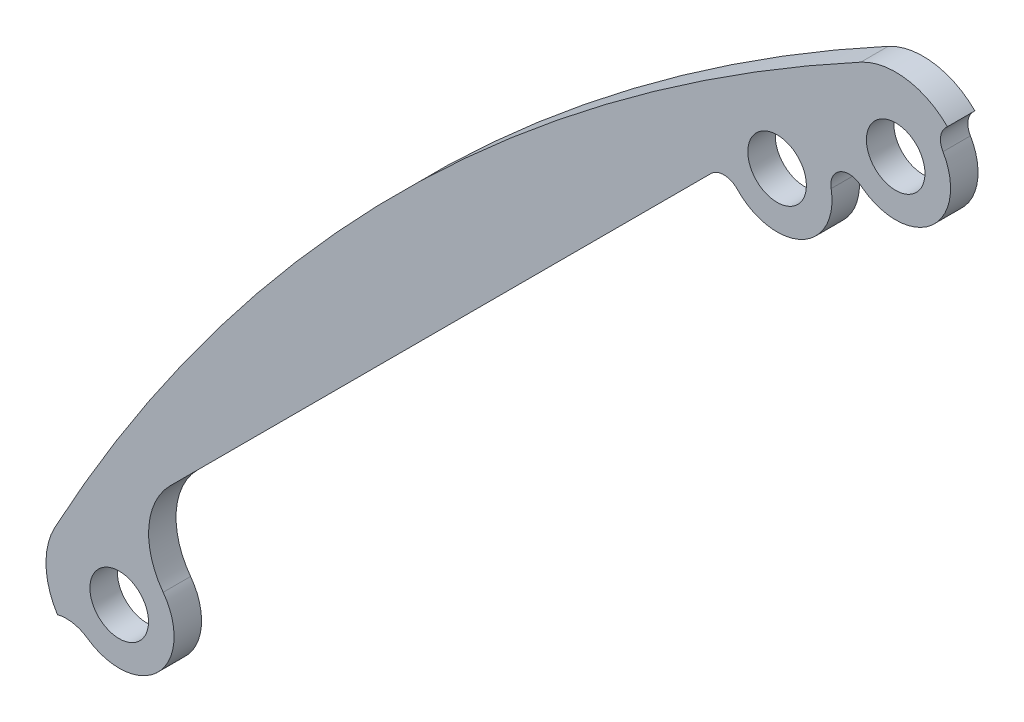
ISO-10303-21;
HEADER;
FILE_DESCRIPTION(('STEP AP214'),'2;1');
FILE_NAME('part.step','',(''),(''),'','','');
FILE_SCHEMA(('AUTOMOTIVE_DESIGN { 1 0 10303 214 1 1 1 1 }'));
ENDSEC;
DATA;
#1=APPLICATION_CONTEXT('core data for automotive mechanical design processes');
#2=APPLICATION_PROTOCOL_DEFINITION('international standard','automotive_design',2000,#1);
#3=PRODUCT_CONTEXT('',#1,'mechanical');
#4=PRODUCT('Part','Part','',(#3));
#5=PRODUCT_RELATED_PRODUCT_CATEGORY('part','',(#4));
#6=PRODUCT_DEFINITION_FORMATION('','',#4);
#7=PRODUCT_DEFINITION_CONTEXT('part definition',#1,'design');
#8=PRODUCT_DEFINITION('design','',#6,#7);
#9=PRODUCT_DEFINITION_SHAPE('','',#8);
#10=(LENGTH_UNIT() NAMED_UNIT(*) SI_UNIT(.MILLI.,.METRE.));
#11=(NAMED_UNIT(*) PLANE_ANGLE_UNIT() SI_UNIT($,.RADIAN.));
#12=(NAMED_UNIT(*) SI_UNIT($,.STERADIAN.) SOLID_ANGLE_UNIT());
#13=UNCERTAINTY_MEASURE_WITH_UNIT(LENGTH_MEASURE(1.E-05),#10,'distance_accuracy_value','');
#14=(GEOMETRIC_REPRESENTATION_CONTEXT(3) GLOBAL_UNCERTAINTY_ASSIGNED_CONTEXT((#13)) GLOBAL_UNIT_ASSIGNED_CONTEXT((#10,
#11,#12)) REPRESENTATION_CONTEXT('',''));
#15=CARTESIAN_POINT('',(0.,0.,0.));
#16=DIRECTION('',(0.,0.,1.));
#17=DIRECTION('',(1.,0.,0.));
#18=AXIS2_PLACEMENT_3D('',#15,#16,#17);
#19=CARTESIAN_POINT('',(-49.9380439181931,92.3644507894832,1.5));
#20=DIRECTION('',(0.,0.,-1.));
#21=DIRECTION('',(-1.,0.,0.));
#22=AXIS2_PLACEMENT_3D('',#19,#20,#21);
#23=CYLINDRICAL_SURFACE('',#22,4.);
#24=DIRECTION('',(0.,0.,-1.));
#25=VECTOR('',#24,1.);
#26=CARTESIAN_POINT('',(-51.8404455912932,95.8830965339181,6.5));
#27=LINE('',#26,#25);
#28=CARTESIAN_POINT('',(-51.8404455912549,95.8830965338473,3.));
#29=VERTEX_POINT('',#28);
#30=CARTESIAN_POINT('',(-51.840445591251,95.88309653384,1.5));
#31=VERTEX_POINT('',#30);
#32=EDGE_CURVE('E262',#29,#31,#27,.T.);
#33=ORIENTED_EDGE('',*,*,#32,.F.);
#34=CARTESIAN_POINT('',(-49.9380439181931,92.3644507894832,3.));
#35=DIRECTION('',(0.,0.,1.));
#36=DIRECTION('',(1.,0.,0.));
#37=AXIS2_PLACEMENT_3D('',#34,#35,#36);
#38=CIRCLE('',#37,4.);
#39=CARTESIAN_POINT('',(-47.1096167933636,95.1928779142894,3.));
#40=VERTEX_POINT('',#39);
#41=EDGE_CURVE('E317',#29,#40,#38,.F.);
#42=ORIENTED_EDGE('',*,*,#41,.T.);
#43=DIRECTION('',(0.,0.,1.));
#44=VECTOR('',#43,1.);
#45=CARTESIAN_POINT('',(-47.1096167933636,95.1928779142894,1.5));
#46=LINE('',#45,#44);
#47=CARTESIAN_POINT('',(-47.1096167934353,95.1928779142177,1.5));
#48=VERTEX_POINT('',#47);
#49=EDGE_CURVE('E267',#48,#40,#46,.T.);
#50=ORIENTED_EDGE('',*,*,#49,.F.);
#51=CARTESIAN_POINT('',(-49.9380439181931,92.3644507894832,1.5));
#52=DIRECTION('',(0.,0.,-1.));
#53=DIRECTION('',(-1.,0.,0.));
#54=AXIS2_PLACEMENT_3D('',#51,#52,#53);
#55=CIRCLE('',#54,4.);
#56=EDGE_CURVE('E284',#48,#31,#55,.F.);
#57=ORIENTED_EDGE('',*,*,#56,.T.);
#58=EDGE_LOOP('',(#33,#42,#50,#57));
#59=FACE_BOUND('',#58,.T.);
#60=ADVANCED_FACE('F101',(#59),#23,.T.);
#61=CARTESIAN_POINT('',(4.84334794492725E-12,9.20178907339733E-11,1.5));
#62=DIRECTION('',(0.,0.,-1.));
#63=DIRECTION('',(-1.,0.,0.));
#64=AXIS2_PLACEMENT_3D('',#61,#62,#63);
#65=CYLINDRICAL_SURFACE('',#64,109.);
#66=DIRECTION('',(0.,0.,1.));
#67=VECTOR('',#66,1.);
#68=CARTESIAN_POINT('',(-95.8830965339179,51.8404455912935,-3.5));
#69=LINE('',#68,#67);
#70=CARTESIAN_POINT('',(-95.8830965339179,51.8404455912935,1.5));
#71=VERTEX_POINT('',#70);
#72=CARTESIAN_POINT('',(-95.8830965338054,51.8404455912327,3.));
#73=VERTEX_POINT('',#72);
#74=EDGE_CURVE('E290',#71,#73,#69,.T.);
#75=ORIENTED_EDGE('',*,*,#74,.T.);
#76=CARTESIAN_POINT('',(4.84334794492725E-12,9.20178907339733E-11,3.));
#77=DIRECTION('',(0.,0.,1.));
#78=DIRECTION('',(1.,0.,0.));
#79=AXIS2_PLACEMENT_3D('',#76,#77,#78);
#80=CIRCLE('',#79,109.);
#81=EDGE_CURVE('E310',#73,#29,#80,.F.);
#82=ORIENTED_EDGE('',*,*,#81,.T.);
#83=ORIENTED_EDGE('',*,*,#32,.T.);
#84=CARTESIAN_POINT('',(0.,0.,1.5));
#85=DIRECTION('',(0.,0.,1.));
#86=DIRECTION('',(1.,0.,0.));
#87=AXIS2_PLACEMENT_3D('',#84,#85,#86);
#88=CIRCLE('',#87,109.000000000167);
#89=EDGE_CURVE('E264',#31,#71,#88,.T.);
#90=ORIENTED_EDGE('',*,*,#89,.T.);
#91=EDGE_LOOP('',(#75,#82,#83,#90));
#92=FACE_BOUND('',#91,.T.);
#93=ADVANCED_FACE('F357',(#92),#65,.T.);
#94=CARTESIAN_POINT('',(-49.9380439181764,92.3644507894767,0.));
#95=DIRECTION('',(0.,0.,1.));
#96=DIRECTION('',(1.,0.,0.));
#97=AXIS2_PLACEMENT_3D('',#94,#95,#96);
#98=CYLINDRICAL_SURFACE('',#97,1.6);
#99=CARTESIAN_POINT('',(-49.9380439181764,92.3644507894767,1.5));
#100=DIRECTION('',(0.,0.,-1.));
#101=DIRECTION('',(-1.,0.,0.));
#102=AXIS2_PLACEMENT_3D('',#99,#100,#101);
#103=CIRCLE('',#102,1.6);
#104=CARTESIAN_POINT('',(-51.5380439181764,92.3644507894767,1.5));
#105=VERTEX_POINT('',#104);
#106=EDGE_CURVE('E272',#105,#105,#103,.F.);
#107=ORIENTED_EDGE('',*,*,#106,.F.);
#108=EDGE_LOOP('',(#107));
#109=FACE_BOUND('',#108,.T.);
#110=CARTESIAN_POINT('',(-49.9380439181764,92.3644507894767,3.));
#111=DIRECTION('',(0.,0.,1.));
#112=DIRECTION('',(1.,0.,0.));
#113=AXIS2_PLACEMENT_3D('',#110,#111,#112);
#114=CIRCLE('',#113,1.6);
#115=CARTESIAN_POINT('',(-48.3380439181764,92.3644507894767,3.));
#116=VERTEX_POINT('',#115);
#117=EDGE_CURVE('E233',#116,#116,#114,.F.);
#118=ORIENTED_EDGE('',*,*,#117,.F.);
#119=EDGE_LOOP('',(#118));
#120=FACE_BOUND('',#119,.T.);
#121=ADVANCED_FACE('F390',(#109,#120),#98,.F.);
#122=CARTESIAN_POINT('',(-92.3644507894765,49.9380439181767,0.));
#123=DIRECTION('',(0.,0.,1.));
#124=DIRECTION('',(1.,0.,0.));
#125=AXIS2_PLACEMENT_3D('',#122,#123,#124);
#126=CYLINDRICAL_SURFACE('',#125,1.59999999999998);
#127=CARTESIAN_POINT('',(-92.3644507894765,49.9380439181767,1.5));
#128=DIRECTION('',(0.,0.,-1.));
#129=DIRECTION('',(-1.,0.,0.));
#130=AXIS2_PLACEMENT_3D('',#127,#128,#129);
#131=CIRCLE('',#130,1.59999999999998);
#132=CARTESIAN_POINT('',(-93.9644507894765,49.9380439181767,1.5));
#133=VERTEX_POINT('',#132);
#134=EDGE_CURVE('E281',#133,#133,#131,.F.);
#135=ORIENTED_EDGE('',*,*,#134,.F.);
#136=EDGE_LOOP('',(#135));
#137=FACE_BOUND('',#136,.T.);
#138=CARTESIAN_POINT('',(-92.3644507894765,49.9380439181767,3.));
#139=DIRECTION('',(0.,0.,1.));
#140=DIRECTION('',(1.,0.,0.));
#141=AXIS2_PLACEMENT_3D('',#138,#139,#140);
#142=CIRCLE('',#141,1.59999999999998);
#143=CARTESIAN_POINT('',(-90.7644507894766,49.9380439181767,3.));
#144=VERTEX_POINT('',#143);
#145=EDGE_CURVE('E300',#144,#144,#142,.F.);
#146=ORIENTED_EDGE('',*,*,#145,.F.);
#147=EDGE_LOOP('',(#146));
#148=FACE_BOUND('',#147,.T.);
#149=ADVANCED_FACE('F422',(#137,#148),#126,.F.);
#150=CARTESIAN_POINT('',(-92.3644507894765,49.9380439181767,1.5));
#151=DIRECTION('',(0.,0.,1.));
#152=DIRECTION('',(1.,0.,0.));
#153=AXIS2_PLACEMENT_3D('',#150,#151,#152);
#154=CYLINDRICAL_SURFACE('',#153,3.00000000000003);
#155=CARTESIAN_POINT('',(-92.3644507894765,49.9380439181767,3.));
#156=DIRECTION('',(0.,0.,1.));
#157=DIRECTION('',(1.,0.,0.));
#158=AXIS2_PLACEMENT_3D('',#155,#156,#157);
#159=CIRCLE('',#158,3.00000000000003);
#160=CARTESIAN_POINT('',(-94.0905838642911,47.4843804106778,3.));
#161=VERTEX_POINT('',#160);
#162=CARTESIAN_POINT('',(-89.9618423894396,51.7345607914823,3.));
#163=VERTEX_POINT('',#162);
#164=EDGE_CURVE('E313',#161,#163,#159,.T.);
#165=ORIENTED_EDGE('',*,*,#164,.F.);
#166=DIRECTION('',(0.,0.,1.));
#167=VECTOR('',#166,1.);
#168=CARTESIAN_POINT('',(-94.0905838642911,47.4843804106778,1.5));
#169=LINE('',#168,#167);
#170=CARTESIAN_POINT('',(-94.0905838642911,47.4843804106778,1.5));
#171=VERTEX_POINT('',#170);
#172=EDGE_CURVE('E251',#161,#171,#169,.F.);
#173=ORIENTED_EDGE('',*,*,#172,.T.);
#174=CARTESIAN_POINT('',(-92.3644507894765,49.9380439181767,1.5));
#175=DIRECTION('',(0.,0.,-1.));
#176=DIRECTION('',(-1.,0.,0.));
#177=AXIS2_PLACEMENT_3D('',#174,#175,#176);
#178=CIRCLE('',#177,3.00000000000003);
#179=CARTESIAN_POINT('',(-89.9618423894396,51.7345607914823,1.5));
#180=VERTEX_POINT('',#179);
#181=EDGE_CURVE('E268',#180,#171,#178,.T.);
#182=ORIENTED_EDGE('',*,*,#181,.F.);
#183=DIRECTION('',(0.,0.,1.));
#184=VECTOR('',#183,1.);
#185=CARTESIAN_POINT('',(-89.9618423894396,51.7345607914823,1.5));
#186=LINE('',#185,#184);
#187=EDGE_CURVE('E245',#180,#163,#186,.T.);
#188=ORIENTED_EDGE('',*,*,#187,.T.);
#189=EDGE_LOOP('',(#165,#173,#182,#188));
#190=FACE_BOUND('',#189,.T.);
#191=ADVANCED_FACE('F347',(#190),#154,.T.);
#192=CARTESIAN_POINT('',(-49.9380439181764,92.3644507894767,1.5));
#193=DIRECTION('',(0.,0.,1.));
#194=DIRECTION('',(1.,0.,0.));
#195=AXIS2_PLACEMENT_3D('',#192,#193,#194);
#196=CYLINDRICAL_SURFACE('',#195,3.);
#197=CARTESIAN_POINT('',(-49.9380439181764,92.3644507894767,3.));
#198=DIRECTION('',(0.,0.,1.));
#199=DIRECTION('',(1.,0.,0.));
#200=AXIS2_PLACEMENT_3D('',#197,#198,#199);
#201=CIRCLE('',#200,3.);
#202=CARTESIAN_POINT('',(-51.734560791482,89.9618423894398,3.));
#203=VERTEX_POINT('',#202);
#204=CARTESIAN_POINT('',(-47.3537542416421,93.8880802942312,3.));
#205=VERTEX_POINT('',#204);
#206=EDGE_CURVE('E210',#203,#205,#201,.T.);
#207=ORIENTED_EDGE('',*,*,#206,.F.);
#208=DIRECTION('',(0.,0.,1.));
#209=VECTOR('',#208,1.);
#210=CARTESIAN_POINT('',(-51.734560791482,89.9618423894398,1.5));
#211=LINE('',#210,#209);
#212=CARTESIAN_POINT('',(-51.734560791482,89.9618423894398,1.5));
#213=VERTEX_POINT('',#212);
#214=EDGE_CURVE('E209',#203,#213,#211,.F.);
#215=ORIENTED_EDGE('',*,*,#214,.T.);
#216=CARTESIAN_POINT('',(-49.9380439181764,92.3644507894767,1.5));
#217=DIRECTION('',(0.,0.,-1.));
#218=DIRECTION('',(-1.,0.,0.));
#219=AXIS2_PLACEMENT_3D('',#216,#217,#218);
#220=CIRCLE('',#219,3.);
#221=CARTESIAN_POINT('',(-47.3537542416421,93.8880802942312,1.5));
#222=VERTEX_POINT('',#221);
#223=EDGE_CURVE('E271',#222,#213,#220,.T.);
#224=ORIENTED_EDGE('',*,*,#223,.F.);
#225=DIRECTION('',(0.,0.,1.));
#226=VECTOR('',#225,1.);
#227=CARTESIAN_POINT('',(-47.3537542416421,93.8880802942312,1.5));
#228=LINE('',#227,#226);
#229=EDGE_CURVE('E257',#222,#205,#228,.T.);
#230=ORIENTED_EDGE('',*,*,#229,.T.);
#231=EDGE_LOOP('',(#207,#215,#224,#230));
#232=FACE_BOUND('',#231,.T.);
#233=ADVANCED_FACE('F373',(#232),#196,.T.);
#234=CARTESIAN_POINT('',(-47.8167235746167,94.4857711330363,1.5));
#235=DIRECTION('',(-0.707106781186537,0.707106781186558,0.));
#236=DIRECTION('',(-0.707106781186558,-0.707106781186537,0.));
#237=AXIS2_PLACEMENT_3D('',#234,#235,#236);
#238=PLANE('',#237);
#239=DIRECTION('',(0.707106781186558,0.707106781186537,0.));
#240=VECTOR('',#239,1.);
#241=CARTESIAN_POINT('',(-47.8167235746167,94.4857711330363,3.));
#242=LINE('',#241,#240);
#243=CARTESIAN_POINT('',(-47.1994311306505,95.1030635770025,3.));
#244=VERTEX_POINT('',#243);
#245=EDGE_CURVE('E320',#244,#40,#242,.T.);
#246=ORIENTED_EDGE('',*,*,#245,.F.);
#247=DIRECTION('',(0.,0.,-1.));
#248=VECTOR('',#247,1.);
#249=CARTESIAN_POINT('',(-47.1994311306505,95.1030635770025,1.5));
#250=LINE('',#249,#248);
#251=CARTESIAN_POINT('',(-47.1994311306505,95.1030635770025,1.5));
#252=VERTEX_POINT('',#251);
#253=EDGE_CURVE('E255',#244,#252,#250,.T.);
#254=ORIENTED_EDGE('',*,*,#253,.T.);
#255=DIRECTION('',(-0.707106781186558,-0.707106781186537,0.));
#256=VECTOR('',#255,1.);
#257=CARTESIAN_POINT('',(-47.8167235746167,94.4857711330363,1.5));
#258=LINE('',#257,#256);
#259=EDGE_CURVE('E275',#48,#252,#258,.T.);
#260=ORIENTED_EDGE('',*,*,#259,.F.);
#261=ORIENTED_EDGE('',*,*,#49,.T.);
#262=EDGE_LOOP('',(#246,#254,#260,#261));
#263=FACE_BOUND('',#262,.T.);
#264=ADVANCED_FACE('F365',(#263),#238,.F.);
#265=CARTESIAN_POINT('',(-46.4923243494639,94.395956795816,1.5));
#266=DIRECTION('',(0.,0.,1.));
#267=DIRECTION('',(1.,0.,0.));
#268=AXIS2_PLACEMENT_3D('',#265,#266,#267);
#269=CYLINDRICAL_SURFACE('',#268,1.);
#270=CARTESIAN_POINT('',(-46.4923243494639,94.395956795816,3.));
#271=DIRECTION('',(0.,0.,1.));
#272=DIRECTION('',(1.,0.,0.));
#273=AXIS2_PLACEMENT_3D('',#270,#271,#272);
#274=CIRCLE('',#273,1.);
#275=EDGE_CURVE('E322',#205,#244,#274,.F.);
#276=ORIENTED_EDGE('',*,*,#275,.F.);
#277=ORIENTED_EDGE('',*,*,#229,.F.);
#278=CARTESIAN_POINT('',(-46.4923243494639,94.395956795816,1.5));
#279=DIRECTION('',(0.,0.,1.));
#280=DIRECTION('',(1.,0.,0.));
#281=AXIS2_PLACEMENT_3D('',#278,#279,#280);
#282=CIRCLE('',#281,1.);
#283=EDGE_CURVE('E253',#252,#222,#282,.T.);
#284=ORIENTED_EDGE('',*,*,#283,.F.);
#285=ORIENTED_EDGE('',*,*,#253,.F.);
#286=EDGE_LOOP('',(#276,#277,#284,#285));
#287=FACE_BOUND('',#286,.T.);
#288=ADVANCED_FACE('F369',(#287),#269,.F.);
#289=CARTESIAN_POINT('',(-95.2413392475008,45.848604739012,1.5));
#290=DIRECTION('',(0.,0.,-1.));
#291=DIRECTION('',(-1.,0.,0.));
#292=AXIS2_PLACEMENT_3D('',#289,#290,#291);
#293=CYLINDRICAL_SURFACE('',#292,2.);
#294=CARTESIAN_POINT('',(-95.2413392475008,45.848604739012,3.));
#295=DIRECTION('',(0.,0.,1.));
#296=DIRECTION('',(1.,0.,0.));
#297=AXIS2_PLACEMENT_3D('',#294,#295,#296);
#298=CIRCLE('',#297,2.);
#299=CARTESIAN_POINT('',(-95.7364301374804,47.7863573059145,3.));
#300=VERTEX_POINT('',#299);
#301=EDGE_CURVE('E306',#300,#161,#298,.F.);
#302=ORIENTED_EDGE('',*,*,#301,.F.);
#303=DIRECTION('',(0.,0.,-1.));
#304=VECTOR('',#303,1.);
#305=CARTESIAN_POINT('',(-95.7364301374243,47.7863573057409,6.5));
#306=LINE('',#305,#304);
#307=CARTESIAN_POINT('',(-95.7364301372988,47.7863573059923,1.5));
#308=VERTEX_POINT('',#307);
#309=EDGE_CURVE('E260',#300,#308,#306,.T.);
#310=ORIENTED_EDGE('',*,*,#309,.T.);
#311=CARTESIAN_POINT('',(-95.2413392475008,45.848604739012,1.5));
#312=DIRECTION('',(0.,0.,1.));
#313=DIRECTION('',(1.,0.,0.));
#314=AXIS2_PLACEMENT_3D('',#311,#312,#313);
#315=CIRCLE('',#314,2.);
#316=EDGE_CURVE('E248',#171,#308,#315,.T.);
#317=ORIENTED_EDGE('',*,*,#316,.F.);
#318=ORIENTED_EDGE('',*,*,#172,.F.);
#319=EDGE_LOOP('',(#302,#310,#317,#318));
#320=FACE_BOUND('',#319,.T.);
#321=ADVANCED_FACE('F351',(#320),#293,.F.);
#322=CARTESIAN_POINT('',(-92.3644507894765,49.9380439181767,-3.5));
#323=DIRECTION('',(0.,0.,1.));
#324=DIRECTION('',(1.,0.,0.));
#325=AXIS2_PLACEMENT_3D('',#322,#323,#324);
#326=CYLINDRICAL_SURFACE('',#325,4.00000000009412);
#327=CARTESIAN_POINT('',(-92.3644507894765,49.9380439181767,3.));
#328=DIRECTION('',(0.,0.,1.));
#329=DIRECTION('',(1.,0.,0.));
#330=AXIS2_PLACEMENT_3D('',#327,#328,#329);
#331=CIRCLE('',#330,4.00000000009412);
#332=EDGE_CURVE('E308',#73,#300,#331,.T.);
#333=ORIENTED_EDGE('',*,*,#332,.F.);
#334=ORIENTED_EDGE('',*,*,#74,.F.);
#335=CARTESIAN_POINT('',(-92.3644507894765,49.9380439181767,1.5));
#336=DIRECTION('',(0.,0.,1.));
#337=DIRECTION('',(1.,0.,0.));
#338=AXIS2_PLACEMENT_3D('',#335,#336,#337);
#339=CIRCLE('',#338,4.00000000009412);
#340=EDGE_CURVE('E287',#308,#71,#339,.F.);
#341=ORIENTED_EDGE('',*,*,#340,.F.);
#342=ORIENTED_EDGE('',*,*,#309,.F.);
#343=EDGE_LOOP('',(#333,#334,#341,#342));
#344=FACE_BOUND('',#343,.T.);
#345=ADVANCED_FACE('F375',(#344),#326,.T.);
#346=CARTESIAN_POINT('',(-52.059364261736,94.4857711330364,-3.5));
#347=DIRECTION('',(-0.707106781186546,0.707106781186549,0.));
#348=DIRECTION('',(-0.707106781186549,-0.707106781186546,0.));
#349=AXIS2_PLACEMENT_3D('',#346,#347,#348);
#350=PLANE('',#349);
#351=DIRECTION('',(0.707106781186549,0.707106781186546,0.));
#352=VECTOR('',#351,1.);
#353=CARTESIAN_POINT('',(-52.059364261736,94.4857711330364,3.));
#354=LINE('',#353,#352);
#355=CARTESIAN_POINT('',(-89.5867916474698,56.9583437473027,3.));
#356=VERTEX_POINT('',#355);
#357=CARTESIAN_POINT('',(-60.0300648252867,86.5150705694857,3.));
#358=VERTEX_POINT('',#357);
#359=EDGE_CURVE('E324',#356,#358,#354,.T.);
#360=ORIENTED_EDGE('',*,*,#359,.F.);
#361=DIRECTION('',(0.,0.,-1.));
#362=VECTOR('',#361,1.);
#363=CARTESIAN_POINT('',(-89.5867916474698,56.9583437473027,1.5));
#364=LINE('',#363,#362);
#365=CARTESIAN_POINT('',(-89.5867916474698,56.9583437473027,1.5));
#366=VERTEX_POINT('',#365);
#367=EDGE_CURVE('E243',#356,#366,#364,.T.);
#368=ORIENTED_EDGE('',*,*,#367,.T.);
#369=DIRECTION('',(-0.707106781186549,-0.707106781186546,0.));
#370=VECTOR('',#369,1.);
#371=CARTESIAN_POINT('',(-108.848191374299,37.6969440204731,1.5));
#372=LINE('',#371,#370);
#373=CARTESIAN_POINT('',(-60.0300648252867,86.5150705694857,1.5));
#374=VERTEX_POINT('',#373);
#375=EDGE_CURVE('E293',#374,#366,#372,.T.);
#376=ORIENTED_EDGE('',*,*,#375,.F.);
#377=DIRECTION('',(0.,0.,1.));
#378=VECTOR('',#377,1.);
#379=CARTESIAN_POINT('',(-60.0300648252867,86.5150705694857,-3.5));
#380=LINE('',#379,#378);
#381=EDGE_CURVE('E235',#374,#358,#380,.T.);
#382=ORIENTED_EDGE('',*,*,#381,.T.);
#383=EDGE_LOOP('',(#360,#368,#376,#382));
#384=FACE_BOUND('',#383,.T.);
#385=ADVANCED_FACE('F337',(#384),#350,.F.);
#386=CARTESIAN_POINT('',(-86.7583645227236,54.1299166225565,1.5));
#387=DIRECTION('',(0.,0.,1.));
#388=DIRECTION('',(1.,0.,0.));
#389=AXIS2_PLACEMENT_3D('',#386,#387,#388);
#390=CYLINDRICAL_SURFACE('',#389,4.);
#391=CARTESIAN_POINT('',(-86.7583645227236,54.1299166225565,3.));
#392=DIRECTION('',(0.,0.,1.));
#393=DIRECTION('',(1.,0.,0.));
#394=AXIS2_PLACEMENT_3D('',#391,#392,#393);
#395=CIRCLE('',#394,4.);
#396=EDGE_CURVE('E315',#163,#356,#395,.F.);
#397=ORIENTED_EDGE('',*,*,#396,.F.);
#398=ORIENTED_EDGE('',*,*,#187,.F.);
#399=CARTESIAN_POINT('',(-86.7583645227236,54.1299166225565,1.5));
#400=DIRECTION('',(0.,0.,1.));
#401=DIRECTION('',(1.,0.,0.));
#402=AXIS2_PLACEMENT_3D('',#399,#400,#401);
#403=CIRCLE('',#402,4.);
#404=EDGE_CURVE('E240',#366,#180,#403,.T.);
#405=ORIENTED_EDGE('',*,*,#404,.F.);
#406=ORIENTED_EDGE('',*,*,#367,.F.);
#407=EDGE_LOOP('',(#397,#398,#405,#406));
#408=FACE_BOUND('',#407,.T.);
#409=ADVANCED_FACE('F341',(#408),#390,.F.);
#410=CARTESIAN_POINT('',(-54.1299166225562,86.7583645227238,1.5));
#411=DIRECTION('',(0.,0.,1.));
#412=DIRECTION('',(1.,0.,0.));
#413=AXIS2_PLACEMENT_3D('',#410,#411,#412);
#414=CYLINDRICAL_SURFACE('',#413,4.);
#415=CARTESIAN_POINT('',(-54.1299166225562,86.7583645227238,3.));
#416=DIRECTION('',(0.,0.,1.));
#417=DIRECTION('',(1.,0.,0.));
#418=AXIS2_PLACEMENT_3D('',#415,#416,#417);
#419=CIRCLE('',#418,4.);
#420=CARTESIAN_POINT('',(-51.9293949963632,90.0986795636529,3.));
#421=VERTEX_POINT('',#420);
#422=EDGE_CURVE('E202',#421,#203,#419,.F.);
#423=ORIENTED_EDGE('',*,*,#422,.F.);
#424=DIRECTION('',(0.,0.,1.));
#425=VECTOR('',#424,1.);
#426=CARTESIAN_POINT('',(-51.9293949963632,90.0986795636529,1.5));
#427=LINE('',#426,#425);
#428=CARTESIAN_POINT('',(-51.9293949963632,90.0986795636529,1.5));
#429=VERTEX_POINT('',#428);
#430=EDGE_CURVE('E123',#421,#429,#427,.F.);
#431=ORIENTED_EDGE('',*,*,#430,.T.);
#432=CARTESIAN_POINT('',(-54.1299166225562,86.7583645227238,1.5));
#433=DIRECTION('',(0.,0.,1.));
#434=DIRECTION('',(1.,0.,0.));
#435=AXIS2_PLACEMENT_3D('',#432,#433,#434);
#436=CIRCLE('',#435,4.);
#437=EDGE_CURVE('E228',#213,#429,#436,.T.);
#438=ORIENTED_EDGE('',*,*,#437,.F.);
#439=ORIENTED_EDGE('',*,*,#214,.F.);
#440=EDGE_LOOP('',(#423,#431,#438,#439));
#441=FACE_BOUND('',#440,.T.);
#442=ADVANCED_FACE('F208',(#441),#414,.F.);
#443=CARTESIAN_POINT('',(-56.4164588764169,88.5561018103527,-3.5));
#444=DIRECTION('',(0.,0.,1.));
#445=DIRECTION('',(1.,0.,0.));
#446=AXIS2_PLACEMENT_3D('',#443,#444,#445);
#447=CYLINDRICAL_SURFACE('',#446,1.6);
#448=CARTESIAN_POINT('',(-56.4164588764169,88.5561018103527,1.5));
#449=DIRECTION('',(0.,0.,1.));
#450=DIRECTION('',(1.,0.,0.));
#451=AXIS2_PLACEMENT_3D('',#448,#449,#450);
#452=CIRCLE('',#451,1.6);
#453=CARTESIAN_POINT('',(-54.8164588764169,88.5561018103527,1.5));
#454=VERTEX_POINT('',#453);
#455=EDGE_CURVE('E232',#454,#454,#452,.T.);
#456=ORIENTED_EDGE('',*,*,#455,.F.);
#457=EDGE_LOOP('',(#456));
#458=FACE_BOUND('',#457,.T.);
#459=CARTESIAN_POINT('',(-56.4164588764169,88.5561018103527,3.));
#460=DIRECTION('',(0.,0.,1.));
#461=DIRECTION('',(1.,0.,0.));
#462=AXIS2_PLACEMENT_3D('',#459,#460,#461);
#463=CIRCLE('',#462,1.6);
#464=CARTESIAN_POINT('',(-54.8164588764169,88.5561018103527,3.));
#465=VERTEX_POINT('',#464);
#466=EDGE_CURVE('E303',#465,#465,#463,.F.);
#467=ORIENTED_EDGE('',*,*,#466,.F.);
#468=EDGE_LOOP('',(#467));
#469=FACE_BOUND('',#468,.T.);
#470=ADVANCED_FACE('F399',(#458,#469),#447,.F.);
#471=CARTESIAN_POINT('',(-56.4164588764169,88.5561018103527,-6.98528137423858));
#472=DIRECTION('',(0.,0.,1.));
#473=DIRECTION('',(1.,0.,0.));
#474=AXIS2_PLACEMENT_3D('',#471,#472,#473);
#475=CYLINDRICAL_SURFACE('',#474,3.);
#476=DIRECTION('',(0.,0.,1.));
#477=VECTOR('',#476,1.);
#478=CARTESIAN_POINT('',(-53.4637587712878,89.0867260551537,-6.98528137423858));
#479=LINE('',#478,#477);
#480=CARTESIAN_POINT('',(-53.4637587712878,89.0867260551537,1.5));
#481=VERTEX_POINT('',#480);
#482=CARTESIAN_POINT('',(-53.4637587712878,89.0867260551537,3.));
#483=VERTEX_POINT('',#482);
#484=EDGE_CURVE('E217',#481,#483,#479,.T.);
#485=ORIENTED_EDGE('',*,*,#484,.T.);
#486=CARTESIAN_POINT('',(-56.4164588764169,88.5561018103527,3.));
#487=DIRECTION('',(0.,0.,1.));
#488=DIRECTION('',(1.,0.,0.));
#489=AXIS2_PLACEMENT_3D('',#486,#487,#488);
#490=CIRCLE('',#489,3.);
#491=CARTESIAN_POINT('',(-58.5963332521794,86.4949982938125,3.));
#492=VERTEX_POINT('',#491);
#493=EDGE_CURVE('E115',#483,#492,#490,.F.);
#494=ORIENTED_EDGE('',*,*,#493,.T.);
#495=DIRECTION('',(0.,0.,1.));
#496=VECTOR('',#495,1.);
#497=CARTESIAN_POINT('',(-58.5963332521794,86.4949982938125,-6.98528137423858));
#498=LINE('',#497,#496);
#499=CARTESIAN_POINT('',(-58.5963332521794,86.4949982938125,1.5));
#500=VERTEX_POINT('',#499);
#501=EDGE_CURVE('E214',#492,#500,#498,.F.);
#502=ORIENTED_EDGE('',*,*,#501,.T.);
#503=CARTESIAN_POINT('',(-56.4164588764169,88.5561018103527,1.5));
#504=DIRECTION('',(0.,0.,1.));
#505=DIRECTION('',(1.,0.,0.));
#506=AXIS2_PLACEMENT_3D('',#503,#504,#505);
#507=CIRCLE('',#506,3.);
#508=EDGE_CURVE('E225',#481,#500,#507,.F.);
#509=ORIENTED_EDGE('',*,*,#508,.F.);
#510=EDGE_LOOP('',(#485,#494,#502,#509));
#511=FACE_BOUND('',#510,.T.);
#512=ADVANCED_FACE('F230',(#511),#475,.T.);
#513=CARTESIAN_POINT('',(-59.3229580441002,85.8079637882991,-6.98528137423858));
#514=DIRECTION('',(0.,0.,1.));
#515=DIRECTION('',(1.,0.,0.));
#516=AXIS2_PLACEMENT_3D('',#513,#514,#515);
#517=CYLINDRICAL_SURFACE('',#516,1.);
#518=CARTESIAN_POINT('',(-59.3229580441002,85.8079637882991,3.));
#519=DIRECTION('',(0.,0.,1.));
#520=DIRECTION('',(1.,0.,0.));
#521=AXIS2_PLACEMENT_3D('',#518,#519,#520);
#522=CIRCLE('',#521,1.);
#523=EDGE_CURVE('E326',#358,#492,#522,.F.);
#524=ORIENTED_EDGE('',*,*,#523,.F.);
#525=ORIENTED_EDGE('',*,*,#381,.F.);
#526=CARTESIAN_POINT('',(-59.3229580441002,85.8079637882991,1.5));
#527=DIRECTION('',(0.,0.,1.));
#528=DIRECTION('',(1.,0.,0.));
#529=AXIS2_PLACEMENT_3D('',#526,#527,#528);
#530=CIRCLE('',#529,1.);
#531=EDGE_CURVE('E213',#500,#374,#530,.T.);
#532=ORIENTED_EDGE('',*,*,#531,.F.);
#533=ORIENTED_EDGE('',*,*,#501,.F.);
#534=EDGE_LOOP('',(#524,#525,#532,#533));
#535=FACE_BOUND('',#534,.T.);
#536=ADVANCED_FACE('F331',(#535),#517,.F.);
#537=CARTESIAN_POINT('',(-52.4795254029115,89.2636008034206,-6.98528137423858));
#538=DIRECTION('',(0.,0.,-1.));
#539=DIRECTION('',(-1.,0.,0.));
#540=AXIS2_PLACEMENT_3D('',#537,#538,#539);
#541=CYLINDRICAL_SURFACE('',#540,1.);
#542=CARTESIAN_POINT('',(-52.4795254029115,89.2636008034206,3.));
#543=DIRECTION('',(0.,0.,1.));
#544=DIRECTION('',(1.,0.,0.));
#545=AXIS2_PLACEMENT_3D('',#542,#543,#544);
#546=CIRCLE('',#545,1.);
#547=EDGE_CURVE('E12',#483,#421,#546,.F.);
#548=ORIENTED_EDGE('',*,*,#547,.F.);
#549=ORIENTED_EDGE('',*,*,#484,.F.);
#550=CARTESIAN_POINT('',(-52.4795254029115,89.2636008034206,1.5));
#551=DIRECTION('',(0.,0.,1.));
#552=DIRECTION('',(1.,0.,0.));
#553=AXIS2_PLACEMENT_3D('',#550,#551,#552);
#554=CIRCLE('',#553,1.);
#555=EDGE_CURVE('E109',#429,#481,#554,.T.);
#556=ORIENTED_EDGE('',*,*,#555,.F.);
#557=ORIENTED_EDGE('',*,*,#430,.F.);
#558=EDGE_LOOP('',(#548,#549,#556,#557));
#559=FACE_BOUND('',#558,.T.);
#560=ADVANCED_FACE('F103',(#559),#541,.F.);
#561=CARTESIAN_POINT('',(-46.1822253947383,-24.9690219590883,1.5));
#562=DIRECTION('',(0.,0.,1.));
#563=DIRECTION('',(1.,0.,0.));
#564=AXIS2_PLACEMENT_3D('',#561,#562,#563);
#565=PLANE('',#564);
#566=ORIENTED_EDGE('',*,*,#437,.T.);
#567=ORIENTED_EDGE('',*,*,#555,.T.);
#568=ORIENTED_EDGE('',*,*,#508,.T.);
#569=ORIENTED_EDGE('',*,*,#531,.T.);
#570=ORIENTED_EDGE('',*,*,#375,.T.);
#571=ORIENTED_EDGE('',*,*,#404,.T.);
#572=ORIENTED_EDGE('',*,*,#181,.T.);
#573=ORIENTED_EDGE('',*,*,#316,.T.);
#574=ORIENTED_EDGE('',*,*,#340,.T.);
#575=ORIENTED_EDGE('',*,*,#89,.F.);
#576=ORIENTED_EDGE('',*,*,#56,.F.);
#577=ORIENTED_EDGE('',*,*,#259,.T.);
#578=ORIENTED_EDGE('',*,*,#283,.T.);
#579=ORIENTED_EDGE('',*,*,#223,.T.);
#580=EDGE_LOOP('',(#566,#567,#568,#569,#570,#571,#572,#573,#574,#575,#576,#577,#578,#579));
#581=FACE_BOUND('',#580,.T.);
#582=ORIENTED_EDGE('',*,*,#134,.T.);
#583=EDGE_LOOP('',(#582));
#584=FACE_BOUND('',#583,.T.);
#585=ORIENTED_EDGE('',*,*,#106,.T.);
#586=EDGE_LOOP('',(#585));
#587=FACE_BOUND('',#586,.T.);
#588=ORIENTED_EDGE('',*,*,#455,.T.);
#589=EDGE_LOOP('',(#588));
#590=FACE_BOUND('',#589,.T.);
#591=ADVANCED_FACE('F223',(#581,#584,#587,#590),#565,.F.);
#592=CARTESIAN_POINT('',(0.,0.,3.));
#593=DIRECTION('',(0.,0.,1.));
#594=DIRECTION('',(1.,0.,0.));
#595=AXIS2_PLACEMENT_3D('',#592,#593,#594);
#596=PLANE('',#595);
#597=ORIENTED_EDGE('',*,*,#301,.T.);
#598=ORIENTED_EDGE('',*,*,#164,.T.);
#599=ORIENTED_EDGE('',*,*,#396,.T.);
#600=ORIENTED_EDGE('',*,*,#359,.T.);
#601=ORIENTED_EDGE('',*,*,#523,.T.);
#602=ORIENTED_EDGE('',*,*,#493,.F.);
#603=ORIENTED_EDGE('',*,*,#547,.T.);
#604=ORIENTED_EDGE('',*,*,#422,.T.);
#605=ORIENTED_EDGE('',*,*,#206,.T.);
#606=ORIENTED_EDGE('',*,*,#275,.T.);
#607=ORIENTED_EDGE('',*,*,#245,.T.);
#608=ORIENTED_EDGE('',*,*,#41,.F.);
#609=ORIENTED_EDGE('',*,*,#81,.F.);
#610=ORIENTED_EDGE('',*,*,#332,.T.);
#611=EDGE_LOOP('',(#597,#598,#599,#600,#601,#602,#603,#604,#605,#606,#607,#608,#609,#610));
#612=FACE_BOUND('',#611,.T.);
#613=ORIENTED_EDGE('',*,*,#466,.T.);
#614=EDGE_LOOP('',(#613));
#615=FACE_BOUND('',#614,.T.);
#616=ORIENTED_EDGE('',*,*,#145,.T.);
#617=EDGE_LOOP('',(#616));
#618=FACE_BOUND('',#617,.T.);
#619=ORIENTED_EDGE('',*,*,#117,.T.);
#620=EDGE_LOOP('',(#619));
#621=FACE_BOUND('',#620,.T.);
#622=ADVANCED_FACE('F200',(#612,#615,#618,#621),#596,.T.);
#623=CLOSED_SHELL('',(#60,#93,#121,#149,#191,#233,#264,#288,#321,#345,#385,#409,#442,#470,#512,
#536,#560,#591,#622));
#624=MANIFOLD_SOLID_BREP('B2',#623);
#625=ADVANCED_BREP_SHAPE_REPRESENTATION('',(#18,#624),#14);
#626=SHAPE_DEFINITION_REPRESENTATION(#9,#625);
ENDSEC;
END-ISO-10303-21;
